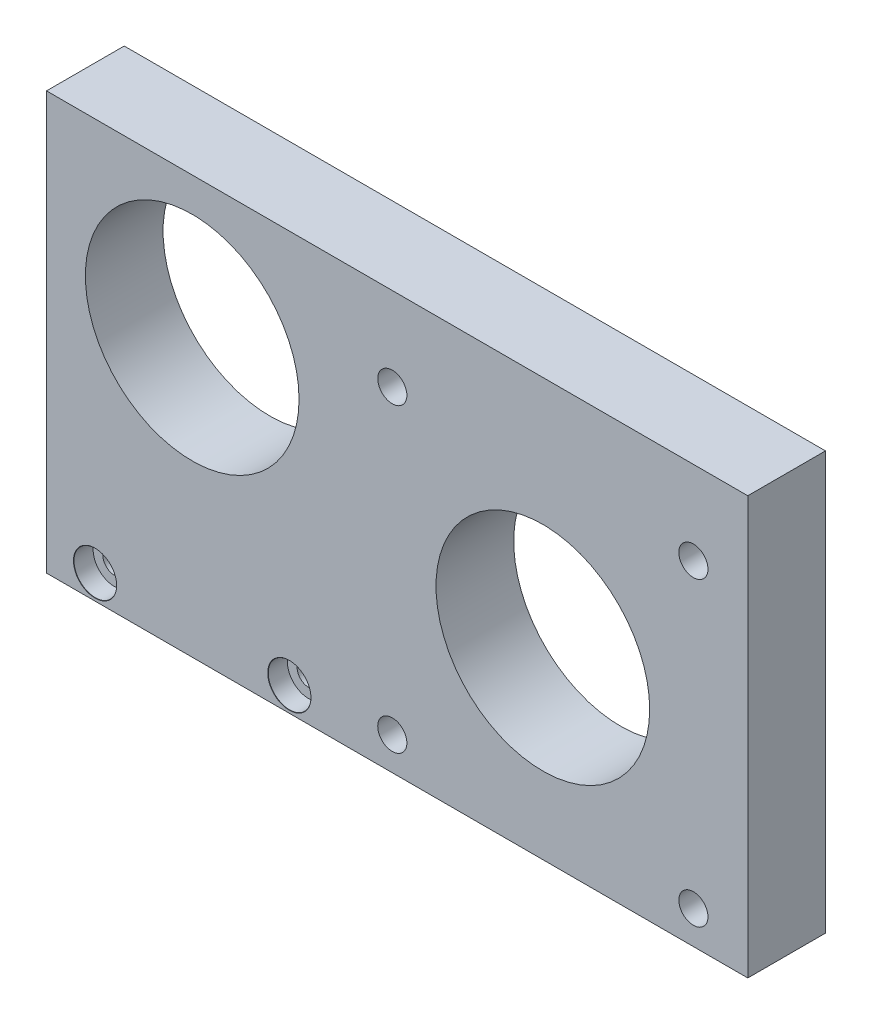
ISO-10303-21;
HEADER;
FILE_DESCRIPTION(('STEP AP214'),'2;1');
FILE_NAME('part.step','',(''),(''),'','','');
FILE_SCHEMA(('AUTOMOTIVE_DESIGN { 1 0 10303 214 1 1 1 1 }'));
ENDSEC;
DATA;
#1=APPLICATION_CONTEXT('core data for automotive mechanical design processes');
#2=APPLICATION_PROTOCOL_DEFINITION('international standard','automotive_design',2000,#1);
#3=PRODUCT_CONTEXT('',#1,'mechanical');
#4=PRODUCT('Part','Part','',(#3));
#5=PRODUCT_RELATED_PRODUCT_CATEGORY('part','',(#4));
#6=PRODUCT_DEFINITION_FORMATION('','',#4);
#7=PRODUCT_DEFINITION_CONTEXT('part definition',#1,'design');
#8=PRODUCT_DEFINITION('design','',#6,#7);
#9=PRODUCT_DEFINITION_SHAPE('','',#8);
#10=(LENGTH_UNIT() NAMED_UNIT(*) SI_UNIT(.MILLI.,.METRE.));
#11=(NAMED_UNIT(*) PLANE_ANGLE_UNIT() SI_UNIT($,.RADIAN.));
#12=(NAMED_UNIT(*) SI_UNIT($,.STERADIAN.) SOLID_ANGLE_UNIT());
#13=UNCERTAINTY_MEASURE_WITH_UNIT(LENGTH_MEASURE(1.E-05),#10,'distance_accuracy_value','');
#14=(GEOMETRIC_REPRESENTATION_CONTEXT(3) GLOBAL_UNCERTAINTY_ASSIGNED_CONTEXT((#13)) GLOBAL_UNIT_ASSIGNED_CONTEXT((#10,
#11,#12)) REPRESENTATION_CONTEXT('',''));
#15=CARTESIAN_POINT('',(0.,0.,0.));
#16=DIRECTION('',(0.,0.,1.));
#17=DIRECTION('',(1.,0.,0.));
#18=AXIS2_PLACEMENT_3D('',#15,#16,#17);
#19=CARTESIAN_POINT('',(-36.1,-21.5,8.));
#20=DIRECTION('',(1.,0.,0.));
#21=DIRECTION('',(0.,0.,-1.));
#22=AXIS2_PLACEMENT_3D('',#19,#20,#21);
#23=PLANE('',#22);
#24=DIRECTION('',(0.,-1.,0.));
#25=VECTOR('',#24,1.);
#26=CARTESIAN_POINT('',(-36.1,-21.5,0.));
#27=LINE('',#26,#25);
#28=CARTESIAN_POINT('',(-36.1,21.5,0.));
#29=VERTEX_POINT('',#28);
#30=CARTESIAN_POINT('',(-36.1,-21.5,0.));
#31=VERTEX_POINT('',#30);
#32=EDGE_CURVE('E106',#29,#31,#27,.T.);
#33=ORIENTED_EDGE('',*,*,#32,.T.);
#34=DIRECTION('',(0.,0.,-1.));
#35=VECTOR('',#34,1.);
#36=CARTESIAN_POINT('',(-36.1,-21.5,8.));
#37=LINE('',#36,#35);
#38=CARTESIAN_POINT('',(-36.1,-21.5,8.));
#39=VERTEX_POINT('',#38);
#40=EDGE_CURVE('E11',#39,#31,#37,.T.);
#41=ORIENTED_EDGE('',*,*,#40,.F.);
#42=DIRECTION('',(0.,-1.,0.));
#43=VECTOR('',#42,1.);
#44=CARTESIAN_POINT('',(-36.1,-21.5,8.));
#45=LINE('',#44,#43);
#46=CARTESIAN_POINT('',(-36.1,21.5,8.));
#47=VERTEX_POINT('',#46);
#48=EDGE_CURVE('E90',#47,#39,#45,.T.);
#49=ORIENTED_EDGE('',*,*,#48,.F.);
#50=DIRECTION('',(0.,0.,-1.));
#51=VECTOR('',#50,1.);
#52=CARTESIAN_POINT('',(-36.1,21.5,8.));
#53=LINE('',#52,#51);
#54=EDGE_CURVE('E102',#47,#29,#53,.T.);
#55=ORIENTED_EDGE('',*,*,#54,.T.);
#56=EDGE_LOOP('',(#33,#41,#49,#55));
#57=FACE_BOUND('',#56,.T.);
#58=ADVANCED_FACE('F38',(#57),#23,.F.);
#59=CARTESIAN_POINT('',(36.1,-21.5,8.));
#60=DIRECTION('',(0.,1.,0.));
#61=DIRECTION('',(-1.,0.,0.));
#62=AXIS2_PLACEMENT_3D('',#59,#60,#61);
#63=PLANE('',#62);
#64=DIRECTION('',(1.,0.,0.));
#65=VECTOR('',#64,1.);
#66=CARTESIAN_POINT('',(36.1,-21.5,0.));
#67=LINE('',#66,#65);
#68=CARTESIAN_POINT('',(36.1,-21.5,0.));
#69=VERTEX_POINT('',#68);
#70=EDGE_CURVE('E95',#31,#69,#67,.T.);
#71=ORIENTED_EDGE('',*,*,#70,.T.);
#72=DIRECTION('',(0.,0.,-1.));
#73=VECTOR('',#72,1.);
#74=CARTESIAN_POINT('',(36.1,-21.5,8.));
#75=LINE('',#74,#73);
#76=CARTESIAN_POINT('',(36.1,-21.5,8.));
#77=VERTEX_POINT('',#76);
#78=EDGE_CURVE('E47',#77,#69,#75,.T.);
#79=ORIENTED_EDGE('',*,*,#78,.F.);
#80=DIRECTION('',(1.,0.,0.));
#81=VECTOR('',#80,1.);
#82=CARTESIAN_POINT('',(36.1,-21.5,8.));
#83=LINE('',#82,#81);
#84=EDGE_CURVE('E85',#39,#77,#83,.T.);
#85=ORIENTED_EDGE('',*,*,#84,.F.);
#86=ORIENTED_EDGE('',*,*,#40,.T.);
#87=EDGE_LOOP('',(#71,#79,#85,#86));
#88=FACE_BOUND('',#87,.T.);
#89=ADVANCED_FACE('F94',(#88),#63,.F.);
#90=CARTESIAN_POINT('',(36.1,-21.5,8.));
#91=DIRECTION('',(-1.,0.,0.));
#92=DIRECTION('',(0.,0.,1.));
#93=AXIS2_PLACEMENT_3D('',#90,#91,#92);
#94=PLANE('',#93);
#95=DIRECTION('',(0.,1.,0.));
#96=VECTOR('',#95,1.);
#97=CARTESIAN_POINT('',(36.1,-21.5,0.));
#98=LINE('',#97,#96);
#99=CARTESIAN_POINT('',(36.1,21.5,0.));
#100=VERTEX_POINT('',#99);
#101=EDGE_CURVE('E72',#69,#100,#98,.T.);
#102=ORIENTED_EDGE('',*,*,#101,.T.);
#103=DIRECTION('',(0.,0.,-1.));
#104=VECTOR('',#103,1.);
#105=CARTESIAN_POINT('',(36.1,21.5,8.));
#106=LINE('',#105,#104);
#107=CARTESIAN_POINT('',(36.1,21.5,8.));
#108=VERTEX_POINT('',#107);
#109=EDGE_CURVE('E97',#108,#100,#106,.T.);
#110=ORIENTED_EDGE('',*,*,#109,.F.);
#111=DIRECTION('',(0.,1.,0.));
#112=VECTOR('',#111,1.);
#113=CARTESIAN_POINT('',(36.1,-21.5,8.));
#114=LINE('',#113,#112);
#115=EDGE_CURVE('E88',#77,#108,#114,.T.);
#116=ORIENTED_EDGE('',*,*,#115,.F.);
#117=ORIENTED_EDGE('',*,*,#78,.T.);
#118=EDGE_LOOP('',(#102,#110,#116,#117));
#119=FACE_BOUND('',#118,.T.);
#120=ADVANCED_FACE('F98',(#119),#94,.F.);
#121=CARTESIAN_POINT('',(36.1,21.5,8.));
#122=DIRECTION('',(0.,-1.,0.));
#123=DIRECTION('',(1.,0.,0.));
#124=AXIS2_PLACEMENT_3D('',#121,#122,#123);
#125=PLANE('',#124);
#126=DIRECTION('',(-1.,0.,0.));
#127=VECTOR('',#126,1.);
#128=CARTESIAN_POINT('',(36.1,21.5,0.));
#129=LINE('',#128,#127);
#130=EDGE_CURVE('E78',#100,#29,#129,.T.);
#131=ORIENTED_EDGE('',*,*,#130,.T.);
#132=ORIENTED_EDGE('',*,*,#54,.F.);
#133=DIRECTION('',(-1.,0.,0.));
#134=VECTOR('',#133,1.);
#135=CARTESIAN_POINT('',(36.1,21.5,8.));
#136=LINE('',#135,#134);
#137=EDGE_CURVE('E55',#108,#47,#136,.T.);
#138=ORIENTED_EDGE('',*,*,#137,.F.);
#139=ORIENTED_EDGE('',*,*,#109,.T.);
#140=EDGE_LOOP('',(#131,#132,#138,#139));
#141=FACE_BOUND('',#140,.T.);
#142=ADVANCED_FACE('F120',(#141),#125,.F.);
#143=CARTESIAN_POINT('',(0.,0.,8.));
#144=DIRECTION('',(0.,0.,1.));
#145=DIRECTION('',(1.,0.,0.));
#146=AXIS2_PLACEMENT_3D('',#143,#144,#145);
#147=PLANE('',#146);
#148=CARTESIAN_POINT('',(-31.1,-19.,8.));
#149=DIRECTION('',(0.,0.,1.));
#150=DIRECTION('',(1.,0.,0.));
#151=AXIS2_PLACEMENT_3D('',#148,#149,#150);
#152=CIRCLE('',#151,2.225);
#153=CARTESIAN_POINT('',(-28.875,-19.,8.));
#154=VERTEX_POINT('',#153);
#155=EDGE_CURVE('E210',#154,#154,#152,.T.);
#156=ORIENTED_EDGE('',*,*,#155,.F.);
#157=EDGE_LOOP('',(#156));
#158=FACE_BOUND('',#157,.T.);
#159=CARTESIAN_POINT('',(-11.1,-19.,8.));
#160=DIRECTION('',(0.,0.,1.));
#161=DIRECTION('',(1.,0.,0.));
#162=AXIS2_PLACEMENT_3D('',#159,#160,#161);
#163=CIRCLE('',#162,2.225);
#164=CARTESIAN_POINT('',(-8.875,-19.,8.));
#165=VERTEX_POINT('',#164);
#166=EDGE_CURVE('E190',#165,#165,#163,.T.);
#167=ORIENTED_EDGE('',*,*,#166,.F.);
#168=EDGE_LOOP('',(#167));
#169=FACE_BOUND('',#168,.T.);
#170=CARTESIAN_POINT('',(-21.1,7.,8.));
#171=DIRECTION('',(0.,0.,1.));
#172=DIRECTION('',(1.,0.,0.));
#173=AXIS2_PLACEMENT_3D('',#170,#171,#172);
#174=CIRCLE('',#173,11.);
#175=CARTESIAN_POINT('',(-10.1,7.,8.));
#176=VERTEX_POINT('',#175);
#177=EDGE_CURVE('E160',#176,#176,#174,.T.);
#178=ORIENTED_EDGE('',*,*,#177,.F.);
#179=EDGE_LOOP('',(#178));
#180=FACE_BOUND('',#179,.T.);
#181=CARTESIAN_POINT('',(-0.500000000000002,-18.1,8.));
#182=DIRECTION('',(0.,0.,1.));
#183=DIRECTION('',(-1.,0.,0.));
#184=AXIS2_PLACEMENT_3D('',#181,#182,#183);
#185=CIRCLE('',#184,1.5);
#186=CARTESIAN_POINT('',(-2.,-18.1,8.));
#187=VERTEX_POINT('',#186);
#188=EDGE_CURVE('E161',#187,#187,#185,.T.);
#189=ORIENTED_EDGE('',*,*,#188,.F.);
#190=EDGE_LOOP('',(#189));
#191=FACE_BOUND('',#190,.T.);
#192=CARTESIAN_POINT('',(30.5,-18.1,8.));
#193=DIRECTION('',(0.,0.,1.));
#194=DIRECTION('',(1.,0.,0.));
#195=AXIS2_PLACEMENT_3D('',#192,#193,#194);
#196=CIRCLE('',#195,1.5);
#197=CARTESIAN_POINT('',(32.,-18.1,8.));
#198=VERTEX_POINT('',#197);
#199=EDGE_CURVE('E127',#198,#198,#196,.T.);
#200=ORIENTED_EDGE('',*,*,#199,.F.);
#201=EDGE_LOOP('',(#200));
#202=FACE_BOUND('',#201,.T.);
#203=CARTESIAN_POINT('',(30.5,12.9,8.));
#204=DIRECTION('',(0.,0.,1.));
#205=DIRECTION('',(-1.,0.,0.));
#206=AXIS2_PLACEMENT_3D('',#203,#204,#205);
#207=CIRCLE('',#206,1.5);
#208=CARTESIAN_POINT('',(29.,12.9,8.));
#209=VERTEX_POINT('',#208);
#210=EDGE_CURVE('E136',#209,#209,#207,.T.);
#211=ORIENTED_EDGE('',*,*,#210,.F.);
#212=EDGE_LOOP('',(#211));
#213=FACE_BOUND('',#212,.T.);
#214=CARTESIAN_POINT('',(-0.500000000000002,12.9,8.));
#215=DIRECTION('',(0.,0.,1.));
#216=DIRECTION('',(1.,0.,0.));
#217=AXIS2_PLACEMENT_3D('',#214,#215,#216);
#218=CIRCLE('',#217,1.5);
#219=CARTESIAN_POINT('',(0.999999999999997,12.9,8.));
#220=VERTEX_POINT('',#219);
#221=EDGE_CURVE('E144',#220,#220,#218,.T.);
#222=ORIENTED_EDGE('',*,*,#221,.F.);
#223=EDGE_LOOP('',(#222));
#224=FACE_BOUND('',#223,.T.);
#225=CARTESIAN_POINT('',(15.,-2.6,8.));
#226=DIRECTION('',(0.,0.,1.));
#227=DIRECTION('',(1.,0.,0.));
#228=AXIS2_PLACEMENT_3D('',#225,#226,#227);
#229=CIRCLE('',#228,11.);
#230=CARTESIAN_POINT('',(26.,-2.6,8.));
#231=VERTEX_POINT('',#230);
#232=EDGE_CURVE('E152',#231,#231,#229,.T.);
#233=ORIENTED_EDGE('',*,*,#232,.F.);
#234=EDGE_LOOP('',(#233));
#235=FACE_BOUND('',#234,.T.);
#236=ORIENTED_EDGE('',*,*,#48,.T.);
#237=ORIENTED_EDGE('',*,*,#84,.T.);
#238=ORIENTED_EDGE('',*,*,#115,.T.);
#239=ORIENTED_EDGE('',*,*,#137,.T.);
#240=EDGE_LOOP('',(#236,#237,#238,#239));
#241=FACE_BOUND('',#240,.T.);
#242=ADVANCED_FACE('F86',(#158,#169,#180,#191,#202,#213,#224,#235,#241),#147,.T.);
#243=CARTESIAN_POINT('',(0.,0.,0.));
#244=DIRECTION('',(0.,0.,1.));
#245=DIRECTION('',(1.,0.,0.));
#246=AXIS2_PLACEMENT_3D('',#243,#244,#245);
#247=PLANE('',#246);
#248=CARTESIAN_POINT('',(-31.1,-19.,0.));
#249=DIRECTION('',(0.,0.,1.));
#250=DIRECTION('',(1.,0.,0.));
#251=AXIS2_PLACEMENT_3D('',#248,#249,#250);
#252=CIRCLE('',#251,1.2);
#253=CARTESIAN_POINT('',(-29.9,-19.,0.));
#254=VERTEX_POINT('',#253);
#255=EDGE_CURVE('E194',#254,#254,#252,.T.);
#256=ORIENTED_EDGE('',*,*,#255,.T.);
#257=EDGE_LOOP('',(#256));
#258=FACE_BOUND('',#257,.T.);
#259=CARTESIAN_POINT('',(-11.1,-19.,0.));
#260=DIRECTION('',(0.,0.,1.));
#261=DIRECTION('',(1.,0.,0.));
#262=AXIS2_PLACEMENT_3D('',#259,#260,#261);
#263=CIRCLE('',#262,1.2);
#264=CARTESIAN_POINT('',(-9.9,-19.,0.));
#265=VERTEX_POINT('',#264);
#266=EDGE_CURVE('E165',#265,#265,#263,.T.);
#267=ORIENTED_EDGE('',*,*,#266,.T.);
#268=EDGE_LOOP('',(#267));
#269=FACE_BOUND('',#268,.T.);
#270=CARTESIAN_POINT('',(-21.1,7.,0.));
#271=DIRECTION('',(0.,0.,1.));
#272=DIRECTION('',(1.,0.,0.));
#273=AXIS2_PLACEMENT_3D('',#270,#271,#272);
#274=CIRCLE('',#273,11.);
#275=CARTESIAN_POINT('',(-10.1,7.,0.));
#276=VERTEX_POINT('',#275);
#277=EDGE_CURVE('E110',#276,#276,#274,.T.);
#278=ORIENTED_EDGE('',*,*,#277,.T.);
#279=EDGE_LOOP('',(#278));
#280=FACE_BOUND('',#279,.T.);
#281=CARTESIAN_POINT('',(-0.500000000000002,-18.1,0.));
#282=DIRECTION('',(0.,0.,1.));
#283=DIRECTION('',(-1.,0.,0.));
#284=AXIS2_PLACEMENT_3D('',#281,#282,#283);
#285=CIRCLE('',#284,1.5);
#286=CARTESIAN_POINT('',(-2.,-18.1,0.));
#287=VERTEX_POINT('',#286);
#288=EDGE_CURVE('E132',#287,#287,#285,.T.);
#289=ORIENTED_EDGE('',*,*,#288,.T.);
#290=EDGE_LOOP('',(#289));
#291=FACE_BOUND('',#290,.T.);
#292=CARTESIAN_POINT('',(30.5,-18.1,0.));
#293=DIRECTION('',(0.,0.,1.));
#294=DIRECTION('',(1.,0.,0.));
#295=AXIS2_PLACEMENT_3D('',#292,#293,#294);
#296=CIRCLE('',#295,1.5);
#297=CARTESIAN_POINT('',(32.,-18.1,0.));
#298=VERTEX_POINT('',#297);
#299=EDGE_CURVE('E131',#298,#298,#296,.T.);
#300=ORIENTED_EDGE('',*,*,#299,.T.);
#301=EDGE_LOOP('',(#300));
#302=FACE_BOUND('',#301,.T.);
#303=CARTESIAN_POINT('',(30.5,12.9,0.));
#304=DIRECTION('',(0.,0.,1.));
#305=DIRECTION('',(-1.,0.,0.));
#306=AXIS2_PLACEMENT_3D('',#303,#304,#305);
#307=CIRCLE('',#306,1.5);
#308=CARTESIAN_POINT('',(29.,12.9,0.));
#309=VERTEX_POINT('',#308);
#310=EDGE_CURVE('E140',#309,#309,#307,.T.);
#311=ORIENTED_EDGE('',*,*,#310,.T.);
#312=EDGE_LOOP('',(#311));
#313=FACE_BOUND('',#312,.T.);
#314=CARTESIAN_POINT('',(-0.500000000000002,12.9,0.));
#315=DIRECTION('',(0.,0.,1.));
#316=DIRECTION('',(1.,0.,0.));
#317=AXIS2_PLACEMENT_3D('',#314,#315,#316);
#318=CIRCLE('',#317,1.5);
#319=CARTESIAN_POINT('',(0.999999999999997,12.9,0.));
#320=VERTEX_POINT('',#319);
#321=EDGE_CURVE('E148',#320,#320,#318,.T.);
#322=ORIENTED_EDGE('',*,*,#321,.T.);
#323=EDGE_LOOP('',(#322));
#324=FACE_BOUND('',#323,.T.);
#325=CARTESIAN_POINT('',(15.,-2.6,0.));
#326=DIRECTION('',(0.,0.,1.));
#327=DIRECTION('',(1.,0.,0.));
#328=AXIS2_PLACEMENT_3D('',#325,#326,#327);
#329=CIRCLE('',#328,11.);
#330=CARTESIAN_POINT('',(26.,-2.6,0.));
#331=VERTEX_POINT('',#330);
#332=EDGE_CURVE('E156',#331,#331,#329,.T.);
#333=ORIENTED_EDGE('',*,*,#332,.T.);
#334=EDGE_LOOP('',(#333));
#335=FACE_BOUND('',#334,.T.);
#336=ORIENTED_EDGE('',*,*,#32,.F.);
#337=ORIENTED_EDGE('',*,*,#130,.F.);
#338=ORIENTED_EDGE('',*,*,#101,.F.);
#339=ORIENTED_EDGE('',*,*,#70,.F.);
#340=EDGE_LOOP('',(#336,#337,#338,#339));
#341=FACE_BOUND('',#340,.T.);
#342=ADVANCED_FACE('F123',(#258,#269,#280,#291,#302,#313,#324,#335,#341),#247,.F.);
#343=CARTESIAN_POINT('',(15.,-2.6,0.));
#344=DIRECTION('',(0.,0.,1.));
#345=DIRECTION('',(1.,0.,0.));
#346=AXIS2_PLACEMENT_3D('',#343,#344,#345);
#347=CYLINDRICAL_SURFACE('',#346,11.);
#348=ORIENTED_EDGE('',*,*,#332,.F.);
#349=EDGE_LOOP('',(#348));
#350=FACE_BOUND('',#349,.T.);
#351=ORIENTED_EDGE('',*,*,#232,.T.);
#352=EDGE_LOOP('',(#351));
#353=FACE_BOUND('',#352,.T.);
#354=ADVANCED_FACE('F234',(#350,#353),#347,.F.);
#355=CARTESIAN_POINT('',(-0.500000000000002,12.9,0.));
#356=DIRECTION('',(0.,0.,1.));
#357=DIRECTION('',(1.,0.,0.));
#358=AXIS2_PLACEMENT_3D('',#355,#356,#357);
#359=CYLINDRICAL_SURFACE('',#358,1.5);
#360=ORIENTED_EDGE('',*,*,#321,.F.);
#361=EDGE_LOOP('',(#360));
#362=FACE_BOUND('',#361,.T.);
#363=ORIENTED_EDGE('',*,*,#221,.T.);
#364=EDGE_LOOP('',(#363));
#365=FACE_BOUND('',#364,.T.);
#366=ADVANCED_FACE('F236',(#362,#365),#359,.F.);
#367=CARTESIAN_POINT('',(30.5,12.9,0.));
#368=DIRECTION('',(0.,0.,1.));
#369=DIRECTION('',(1.,0.,0.));
#370=AXIS2_PLACEMENT_3D('',#367,#368,#369);
#371=CYLINDRICAL_SURFACE('',#370,1.5);
#372=ORIENTED_EDGE('',*,*,#310,.F.);
#373=EDGE_LOOP('',(#372));
#374=FACE_BOUND('',#373,.T.);
#375=ORIENTED_EDGE('',*,*,#210,.T.);
#376=EDGE_LOOP('',(#375));
#377=FACE_BOUND('',#376,.T.);
#378=ADVANCED_FACE('F243',(#374,#377),#371,.F.);
#379=CARTESIAN_POINT('',(30.5,-18.1,0.));
#380=DIRECTION('',(0.,0.,1.));
#381=DIRECTION('',(1.,0.,0.));
#382=AXIS2_PLACEMENT_3D('',#379,#380,#381);
#383=CYLINDRICAL_SURFACE('',#382,1.5);
#384=ORIENTED_EDGE('',*,*,#299,.F.);
#385=EDGE_LOOP('',(#384));
#386=FACE_BOUND('',#385,.T.);
#387=ORIENTED_EDGE('',*,*,#199,.T.);
#388=EDGE_LOOP('',(#387));
#389=FACE_BOUND('',#388,.T.);
#390=ADVANCED_FACE('F261',(#386,#389),#383,.F.);
#391=CARTESIAN_POINT('',(-0.500000000000002,-18.1,0.));
#392=DIRECTION('',(0.,0.,1.));
#393=DIRECTION('',(1.,0.,0.));
#394=AXIS2_PLACEMENT_3D('',#391,#392,#393);
#395=CYLINDRICAL_SURFACE('',#394,1.5);
#396=ORIENTED_EDGE('',*,*,#288,.F.);
#397=EDGE_LOOP('',(#396));
#398=FACE_BOUND('',#397,.T.);
#399=ORIENTED_EDGE('',*,*,#188,.T.);
#400=EDGE_LOOP('',(#399));
#401=FACE_BOUND('',#400,.T.);
#402=ADVANCED_FACE('F264',(#398,#401),#395,.F.);
#403=CARTESIAN_POINT('',(-21.1,7.,0.));
#404=DIRECTION('',(0.,0.,1.));
#405=DIRECTION('',(1.,0.,0.));
#406=AXIS2_PLACEMENT_3D('',#403,#404,#405);
#407=CYLINDRICAL_SURFACE('',#406,11.);
#408=ORIENTED_EDGE('',*,*,#277,.F.);
#409=EDGE_LOOP('',(#408));
#410=FACE_BOUND('',#409,.T.);
#411=ORIENTED_EDGE('',*,*,#177,.T.);
#412=EDGE_LOOP('',(#411));
#413=FACE_BOUND('',#412,.T.);
#414=ADVANCED_FACE('F289',(#410,#413),#407,.F.);
#415=CARTESIAN_POINT('',(-11.1,-19.,8.));
#416=DIRECTION('',(0.,0.,1.));
#417=DIRECTION('',(1.,0.,0.));
#418=AXIS2_PLACEMENT_3D('',#415,#416,#417);
#419=CYLINDRICAL_SURFACE('',#418,1.2);
#420=ORIENTED_EDGE('',*,*,#266,.F.);
#421=EDGE_LOOP('',(#420));
#422=FACE_BOUND('',#421,.T.);
#423=CARTESIAN_POINT('',(-11.1,-19.,6.));
#424=DIRECTION('',(0.,0.,1.));
#425=DIRECTION('',(1.,0.,0.));
#426=AXIS2_PLACEMENT_3D('',#423,#424,#425);
#427=CIRCLE('',#426,1.2);
#428=CARTESIAN_POINT('',(-9.9,-19.,6.));
#429=VERTEX_POINT('',#428);
#430=EDGE_CURVE('E178',#429,#429,#427,.T.);
#431=ORIENTED_EDGE('',*,*,#430,.T.);
#432=EDGE_LOOP('',(#431));
#433=FACE_BOUND('',#432,.T.);
#434=ADVANCED_FACE('F296',(#422,#433),#419,.F.);
#435=CARTESIAN_POINT('',(-8.9,-19.,6.));
#436=DIRECTION('',(0.,0.,-1.));
#437=DIRECTION('',(-1.,0.,0.));
#438=AXIS2_PLACEMENT_3D('',#435,#436,#437);
#439=PLANE('',#438);
#440=ORIENTED_EDGE('',*,*,#430,.F.);
#441=EDGE_LOOP('',(#440));
#442=FACE_BOUND('',#441,.T.);
#443=CARTESIAN_POINT('',(-11.1,-19.,6.));
#444=DIRECTION('',(0.,0.,1.));
#445=DIRECTION('',(1.,0.,0.));
#446=AXIS2_PLACEMENT_3D('',#443,#444,#445);
#447=CIRCLE('',#446,2.2);
#448=CARTESIAN_POINT('',(-8.9,-19.,6.));
#449=VERTEX_POINT('',#448);
#450=EDGE_CURVE('E182',#449,#449,#447,.T.);
#451=ORIENTED_EDGE('',*,*,#450,.T.);
#452=EDGE_LOOP('',(#451));
#453=FACE_BOUND('',#452,.T.);
#454=ADVANCED_FACE('F305',(#442,#453),#439,.F.);
#455=CARTESIAN_POINT('',(-11.1,-19.,8.));
#456=DIRECTION('',(0.,0.,1.));
#457=DIRECTION('',(1.,0.,0.));
#458=AXIS2_PLACEMENT_3D('',#455,#456,#457);
#459=CYLINDRICAL_SURFACE('',#458,2.2);
#460=ORIENTED_EDGE('',*,*,#450,.F.);
#461=EDGE_LOOP('',(#460));
#462=FACE_BOUND('',#461,.T.);
#463=CARTESIAN_POINT('',(-11.1,-19.,7.975));
#464=DIRECTION('',(0.,0.,1.));
#465=DIRECTION('',(1.,0.,0.));
#466=AXIS2_PLACEMENT_3D('',#463,#464,#465);
#467=CIRCLE('',#466,2.2);
#468=CARTESIAN_POINT('',(-8.9,-19.,7.975));
#469=VERTEX_POINT('',#468);
#470=EDGE_CURVE('E186',#469,#469,#467,.T.);
#471=ORIENTED_EDGE('',*,*,#470,.T.);
#472=EDGE_LOOP('',(#471));
#473=FACE_BOUND('',#472,.T.);
#474=ADVANCED_FACE('F314',(#462,#473),#459,.F.);
#475=CARTESIAN_POINT('',(-11.1,-19.,8.));
#476=DIRECTION('',(0.,0.,1.));
#477=DIRECTION('',(1.,0.,0.));
#478=AXIS2_PLACEMENT_3D('',#475,#476,#477);
#479=CONICAL_SURFACE('',#478,2.225,0.785398163397414);
#480=ORIENTED_EDGE('',*,*,#470,.F.);
#481=EDGE_LOOP('',(#480));
#482=FACE_BOUND('',#481,.T.);
#483=ORIENTED_EDGE('',*,*,#166,.T.);
#484=EDGE_LOOP('',(#483));
#485=FACE_BOUND('',#484,.T.);
#486=ADVANCED_FACE('F322',(#482,#485),#479,.F.);
#487=CARTESIAN_POINT('',(-31.1,-19.,8.));
#488=DIRECTION('',(0.,0.,1.));
#489=DIRECTION('',(1.,0.,0.));
#490=AXIS2_PLACEMENT_3D('',#487,#488,#489);
#491=CYLINDRICAL_SURFACE('',#490,1.2);
#492=ORIENTED_EDGE('',*,*,#255,.F.);
#493=EDGE_LOOP('',(#492));
#494=FACE_BOUND('',#493,.T.);
#495=CARTESIAN_POINT('',(-31.1,-19.,6.));
#496=DIRECTION('',(0.,0.,1.));
#497=DIRECTION('',(1.,0.,0.));
#498=AXIS2_PLACEMENT_3D('',#495,#496,#497);
#499=CIRCLE('',#498,1.2);
#500=CARTESIAN_POINT('',(-29.9,-19.,6.));
#501=VERTEX_POINT('',#500);
#502=EDGE_CURVE('E198',#501,#501,#499,.T.);
#503=ORIENTED_EDGE('',*,*,#502,.T.);
#504=EDGE_LOOP('',(#503));
#505=FACE_BOUND('',#504,.T.);
#506=ADVANCED_FACE('F330',(#494,#505),#491,.F.);
#507=CARTESIAN_POINT('',(-28.9,-19.,6.));
#508=DIRECTION('',(0.,0.,-1.));
#509=DIRECTION('',(-1.,0.,0.));
#510=AXIS2_PLACEMENT_3D('',#507,#508,#509);
#511=PLANE('',#510);
#512=ORIENTED_EDGE('',*,*,#502,.F.);
#513=EDGE_LOOP('',(#512));
#514=FACE_BOUND('',#513,.T.);
#515=CARTESIAN_POINT('',(-31.1,-19.,6.));
#516=DIRECTION('',(0.,0.,1.));
#517=DIRECTION('',(1.,0.,0.));
#518=AXIS2_PLACEMENT_3D('',#515,#516,#517);
#519=CIRCLE('',#518,2.2);
#520=CARTESIAN_POINT('',(-28.9,-19.,6.));
#521=VERTEX_POINT('',#520);
#522=EDGE_CURVE('E202',#521,#521,#519,.T.);
#523=ORIENTED_EDGE('',*,*,#522,.T.);
#524=EDGE_LOOP('',(#523));
#525=FACE_BOUND('',#524,.T.);
#526=ADVANCED_FACE('F338',(#514,#525),#511,.F.);
#527=CARTESIAN_POINT('',(-31.1,-19.,8.));
#528=DIRECTION('',(0.,0.,1.));
#529=DIRECTION('',(1.,0.,0.));
#530=AXIS2_PLACEMENT_3D('',#527,#528,#529);
#531=CYLINDRICAL_SURFACE('',#530,2.2);
#532=ORIENTED_EDGE('',*,*,#522,.F.);
#533=EDGE_LOOP('',(#532));
#534=FACE_BOUND('',#533,.T.);
#535=CARTESIAN_POINT('',(-31.1,-19.,7.975));
#536=DIRECTION('',(0.,0.,1.));
#537=DIRECTION('',(1.,0.,0.));
#538=AXIS2_PLACEMENT_3D('',#535,#536,#537);
#539=CIRCLE('',#538,2.2);
#540=CARTESIAN_POINT('',(-28.9,-19.,7.975));
#541=VERTEX_POINT('',#540);
#542=EDGE_CURVE('E206',#541,#541,#539,.T.);
#543=ORIENTED_EDGE('',*,*,#542,.T.);
#544=EDGE_LOOP('',(#543));
#545=FACE_BOUND('',#544,.T.);
#546=ADVANCED_FACE('F346',(#534,#545),#531,.F.);
#547=CARTESIAN_POINT('',(-31.1,-19.,8.));
#548=DIRECTION('',(0.,0.,1.));
#549=DIRECTION('',(1.,0.,0.));
#550=AXIS2_PLACEMENT_3D('',#547,#548,#549);
#551=CONICAL_SURFACE('',#550,2.225,0.785398163397448);
#552=ORIENTED_EDGE('',*,*,#542,.F.);
#553=EDGE_LOOP('',(#552));
#554=FACE_BOUND('',#553,.T.);
#555=ORIENTED_EDGE('',*,*,#155,.T.);
#556=EDGE_LOOP('',(#555));
#557=FACE_BOUND('',#556,.T.);
#558=ADVANCED_FACE('F215',(#554,#557),#551,.F.);
#559=CLOSED_SHELL('',(#58,#89,#120,#142,#242,#342,#354,#366,#378,#390,#402,#414,#434,#454,#474,
#486,#506,#526,#546,#558));
#560=MANIFOLD_SOLID_BREP('B2',#559);
#561=ADVANCED_BREP_SHAPE_REPRESENTATION('',(#18,#560),#14);
#562=SHAPE_DEFINITION_REPRESENTATION(#9,#561);
ENDSEC;
END-ISO-10303-21;
